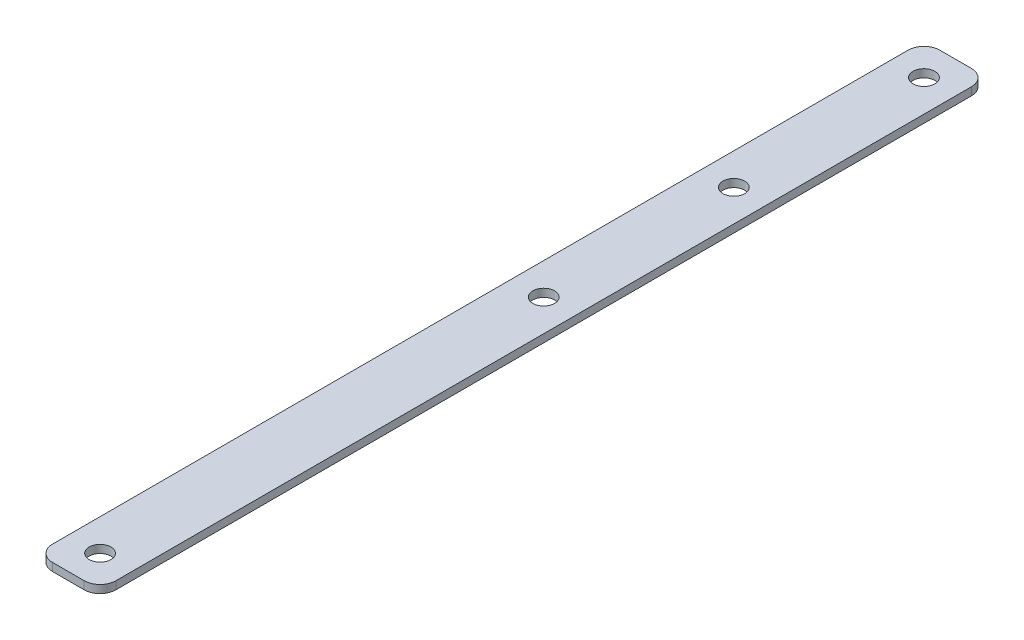
ISO-10303-21;
HEADER;
FILE_DESCRIPTION(('STEP AP214'),'2;1');
FILE_NAME('part.step','',(''),(''),'','','');
FILE_SCHEMA(('AUTOMOTIVE_DESIGN { 1 0 10303 214 1 1 1 1 }'));
ENDSEC;
DATA;
#1=APPLICATION_CONTEXT('core data for automotive mechanical design processes');
#2=APPLICATION_PROTOCOL_DEFINITION('international standard','automotive_design',2000,#1);
#3=PRODUCT_CONTEXT('',#1,'mechanical');
#4=PRODUCT('Part','Part','',(#3));
#5=PRODUCT_RELATED_PRODUCT_CATEGORY('part','',(#4));
#6=PRODUCT_DEFINITION_FORMATION('','',#4);
#7=PRODUCT_DEFINITION_CONTEXT('part definition',#1,'design');
#8=PRODUCT_DEFINITION('design','',#6,#7);
#9=PRODUCT_DEFINITION_SHAPE('','',#8);
#10=(LENGTH_UNIT() NAMED_UNIT(*) SI_UNIT(.MILLI.,.METRE.));
#11=(NAMED_UNIT(*) PLANE_ANGLE_UNIT() SI_UNIT($,.RADIAN.));
#12=(NAMED_UNIT(*) SI_UNIT($,.STERADIAN.) SOLID_ANGLE_UNIT());
#13=UNCERTAINTY_MEASURE_WITH_UNIT(LENGTH_MEASURE(1.E-05),#10,'distance_accuracy_value','');
#14=(GEOMETRIC_REPRESENTATION_CONTEXT(3) GLOBAL_UNCERTAINTY_ASSIGNED_CONTEXT((#13)) GLOBAL_UNIT_ASSIGNED_CONTEXT((#10,
#11,#12)) REPRESENTATION_CONTEXT('',''));
#15=CARTESIAN_POINT('',(0.,0.,0.));
#16=DIRECTION('',(0.,0.,1.));
#17=DIRECTION('',(1.,0.,0.));
#18=AXIS2_PLACEMENT_3D('',#15,#16,#17);
#19=CARTESIAN_POINT('',(3.175,1.5875,-174.625));
#20=DIRECTION('',(0.,1.,0.));
#21=DIRECTION('',(0.,0.,1.));
#22=AXIS2_PLACEMENT_3D('',#19,#20,#21);
#23=PLANE('',#22);
#24=CARTESIAN_POINT('',(6.35,1.5875,-133.35));
#25=DIRECTION('',(0.,1.,0.));
#26=DIRECTION('',(0.,0.,1.));
#27=AXIS2_PLACEMENT_3D('',#24,#25,#26);
#28=CIRCLE('',#27,2.1828125);
#29=CARTESIAN_POINT('',(6.35,1.5875,-131.1671875));
#30=VERTEX_POINT('',#29);
#31=EDGE_CURVE('E193',#30,#30,#28,.T.);
#32=ORIENTED_EDGE('',*,*,#31,.F.);
#33=EDGE_LOOP('',(#32));
#34=FACE_BOUND('',#33,.T.);
#35=CARTESIAN_POINT('',(6.35,1.5875,-171.45));
#36=DIRECTION('',(0.,1.,0.));
#37=DIRECTION('',(0.,0.,1.));
#38=AXIS2_PLACEMENT_3D('',#35,#36,#37);
#39=CIRCLE('',#38,2.1828125);
#40=CARTESIAN_POINT('',(6.35,1.5875,-169.2671875));
#41=VERTEX_POINT('',#40);
#42=EDGE_CURVE('E139',#41,#41,#39,.T.);
#43=ORIENTED_EDGE('',*,*,#42,.F.);
#44=EDGE_LOOP('',(#43));
#45=FACE_BOUND('',#44,.T.);
#46=CARTESIAN_POINT('',(3.175,1.5875,-174.625));
#47=DIRECTION('',(0.,1.,0.));
#48=DIRECTION('',(0.,0.,1.));
#49=AXIS2_PLACEMENT_3D('',#46,#47,#48);
#50=CIRCLE('',#49,3.17500000000001);
#51=CARTESIAN_POINT('',(3.17500000000002,1.5875,-177.8));
#52=VERTEX_POINT('',#51);
#53=CARTESIAN_POINT('',(0.,1.5875,-174.625));
#54=VERTEX_POINT('',#53);
#55=EDGE_CURVE('E150',#52,#54,#50,.T.);
#56=ORIENTED_EDGE('',*,*,#55,.T.);
#57=DIRECTION('',(0.,0.,1.));
#58=VECTOR('',#57,1.);
#59=CARTESIAN_POINT('',(0.,1.5875,-3.17500000000002));
#60=LINE('',#59,#58);
#61=CARTESIAN_POINT('',(0.,1.5875,-3.17500000000002));
#62=VERTEX_POINT('',#61);
#63=EDGE_CURVE('E98',#54,#62,#60,.T.);
#64=ORIENTED_EDGE('',*,*,#63,.T.);
#65=CARTESIAN_POINT('',(3.175,1.5875,-3.175));
#66=DIRECTION('',(0.,1.,0.));
#67=DIRECTION('',(0.,0.,-1.));
#68=AXIS2_PLACEMENT_3D('',#65,#66,#67);
#69=CIRCLE('',#68,3.175);
#70=CARTESIAN_POINT('',(3.17500000000002,1.5875,0.));
#71=VERTEX_POINT('',#70);
#72=EDGE_CURVE('E165',#62,#71,#69,.T.);
#73=ORIENTED_EDGE('',*,*,#72,.T.);
#74=DIRECTION('',(1.,0.,0.));
#75=VECTOR('',#74,1.);
#76=CARTESIAN_POINT('',(3.17500000000002,1.5875,0.));
#77=LINE('',#76,#75);
#78=CARTESIAN_POINT('',(9.52499999999997,1.5875,0.));
#79=VERTEX_POINT('',#78);
#80=EDGE_CURVE('E178',#71,#79,#77,.T.);
#81=ORIENTED_EDGE('',*,*,#80,.T.);
#82=CARTESIAN_POINT('',(9.525,1.5875,-3.175));
#83=DIRECTION('',(0.,1.,0.));
#84=DIRECTION('',(0.,0.,-1.));
#85=AXIS2_PLACEMENT_3D('',#82,#83,#84);
#86=CIRCLE('',#85,3.175);
#87=CARTESIAN_POINT('',(12.7,1.5875,-3.17500000000002));
#88=VERTEX_POINT('',#87);
#89=EDGE_CURVE('E117',#79,#88,#86,.T.);
#90=ORIENTED_EDGE('',*,*,#89,.T.);
#91=DIRECTION('',(0.,0.,-1.));
#92=VECTOR('',#91,1.);
#93=CARTESIAN_POINT('',(12.7,1.5875,-3.17500000000002));
#94=LINE('',#93,#92);
#95=CARTESIAN_POINT('',(12.7,1.5875,-174.625));
#96=VERTEX_POINT('',#95);
#97=EDGE_CURVE('E111',#88,#96,#94,.T.);
#98=ORIENTED_EDGE('',*,*,#97,.T.);
#99=CARTESIAN_POINT('',(9.525,1.5875,-174.625));
#100=DIRECTION('',(0.,1.,0.));
#101=DIRECTION('',(0.,0.,1.));
#102=AXIS2_PLACEMENT_3D('',#99,#100,#101);
#103=CIRCLE('',#102,3.17500000000001);
#104=CARTESIAN_POINT('',(9.52499999999997,1.5875,-177.8));
#105=VERTEX_POINT('',#104);
#106=EDGE_CURVE('E115',#96,#105,#103,.T.);
#107=ORIENTED_EDGE('',*,*,#106,.T.);
#108=DIRECTION('',(-1.,0.,0.));
#109=VECTOR('',#108,1.);
#110=CARTESIAN_POINT('',(3.17500000000002,1.5875,-177.8));
#111=LINE('',#110,#109);
#112=EDGE_CURVE('E55',#105,#52,#111,.T.);
#113=ORIENTED_EDGE('',*,*,#112,.T.);
#114=EDGE_LOOP('',(#56,#64,#73,#81,#90,#98,#107,#113));
#115=FACE_BOUND('',#114,.T.);
#116=CARTESIAN_POINT('',(6.35,1.5875,-6.35));
#117=DIRECTION('',(0.,1.,0.));
#118=DIRECTION('',(0.,0.,1.));
#119=AXIS2_PLACEMENT_3D('',#116,#117,#118);
#120=CIRCLE('',#119,2.1828125);
#121=CARTESIAN_POINT('',(6.35,1.5875,-4.1671875));
#122=VERTEX_POINT('',#121);
#123=EDGE_CURVE('E187',#122,#122,#120,.T.);
#124=ORIENTED_EDGE('',*,*,#123,.F.);
#125=EDGE_LOOP('',(#124));
#126=FACE_BOUND('',#125,.T.);
#127=CARTESIAN_POINT('',(6.35,1.5875,-95.25));
#128=DIRECTION('',(0.,1.,0.));
#129=DIRECTION('',(0.,0.,1.));
#130=AXIS2_PLACEMENT_3D('',#127,#128,#129);
#131=CIRCLE('',#130,2.1828125);
#132=CARTESIAN_POINT('',(6.35,1.5875,-93.0671875));
#133=VERTEX_POINT('',#132);
#134=EDGE_CURVE('E199',#133,#133,#131,.T.);
#135=ORIENTED_EDGE('',*,*,#134,.F.);
#136=EDGE_LOOP('',(#135));
#137=FACE_BOUND('',#136,.T.);
#138=ADVANCED_FACE('F38',(#34,#45,#115,#126,#137),#23,.T.);
#139=CARTESIAN_POINT('',(3.175,0.,-174.625));
#140=DIRECTION('',(0.,1.,0.));
#141=DIRECTION('',(0.,0.,1.));
#142=AXIS2_PLACEMENT_3D('',#139,#140,#141);
#143=PLANE('',#142);
#144=CARTESIAN_POINT('',(3.175,0.,-174.625));
#145=DIRECTION('',(0.,1.,0.));
#146=DIRECTION('',(0.,0.,1.));
#147=AXIS2_PLACEMENT_3D('',#144,#145,#146);
#148=CIRCLE('',#147,3.17500000000001);
#149=CARTESIAN_POINT('',(3.17500000000002,0.,-177.8));
#150=VERTEX_POINT('',#149);
#151=CARTESIAN_POINT('',(0.,0.,-174.625));
#152=VERTEX_POINT('',#151);
#153=EDGE_CURVE('E135',#150,#152,#148,.T.);
#154=ORIENTED_EDGE('',*,*,#153,.F.);
#155=DIRECTION('',(-1.,0.,0.));
#156=VECTOR('',#155,1.);
#157=CARTESIAN_POINT('',(3.17500000000002,0.,-177.8));
#158=LINE('',#157,#156);
#159=CARTESIAN_POINT('',(9.52499999999997,0.,-177.8));
#160=VERTEX_POINT('',#159);
#161=EDGE_CURVE('E90',#160,#150,#158,.T.);
#162=ORIENTED_EDGE('',*,*,#161,.F.);
#163=CARTESIAN_POINT('',(9.525,0.,-174.625));
#164=DIRECTION('',(0.,1.,0.));
#165=DIRECTION('',(0.,0.,1.));
#166=AXIS2_PLACEMENT_3D('',#163,#164,#165);
#167=CIRCLE('',#166,3.17500000000001);
#168=CARTESIAN_POINT('',(12.7,0.,-174.625));
#169=VERTEX_POINT('',#168);
#170=EDGE_CURVE('E84',#169,#160,#167,.T.);
#171=ORIENTED_EDGE('',*,*,#170,.F.);
#172=DIRECTION('',(0.,0.,-1.));
#173=VECTOR('',#172,1.);
#174=CARTESIAN_POINT('',(12.7,0.,-3.17500000000002));
#175=LINE('',#174,#173);
#176=CARTESIAN_POINT('',(12.7,0.,-3.17500000000002));
#177=VERTEX_POINT('',#176);
#178=EDGE_CURVE('E125',#177,#169,#175,.T.);
#179=ORIENTED_EDGE('',*,*,#178,.F.);
#180=CARTESIAN_POINT('',(9.525,0.,-3.175));
#181=DIRECTION('',(0.,1.,0.));
#182=DIRECTION('',(0.,0.,-1.));
#183=AXIS2_PLACEMENT_3D('',#180,#181,#182);
#184=CIRCLE('',#183,3.175);
#185=CARTESIAN_POINT('',(9.52499999999997,0.,0.));
#186=VERTEX_POINT('',#185);
#187=EDGE_CURVE('E145',#186,#177,#184,.T.);
#188=ORIENTED_EDGE('',*,*,#187,.F.);
#189=DIRECTION('',(1.,0.,0.));
#190=VECTOR('',#189,1.);
#191=CARTESIAN_POINT('',(3.17500000000002,0.,0.));
#192=LINE('',#191,#190);
#193=CARTESIAN_POINT('',(3.17500000000002,0.,0.));
#194=VERTEX_POINT('',#193);
#195=EDGE_CURVE('E143',#194,#186,#192,.T.);
#196=ORIENTED_EDGE('',*,*,#195,.F.);
#197=CARTESIAN_POINT('',(3.175,0.,-3.175));
#198=DIRECTION('',(0.,1.,0.));
#199=DIRECTION('',(0.,0.,-1.));
#200=AXIS2_PLACEMENT_3D('',#197,#198,#199);
#201=CIRCLE('',#200,3.175);
#202=CARTESIAN_POINT('',(0.,0.,-3.17500000000002));
#203=VERTEX_POINT('',#202);
#204=EDGE_CURVE('E141',#203,#194,#201,.T.);
#205=ORIENTED_EDGE('',*,*,#204,.F.);
#206=DIRECTION('',(0.,0.,1.));
#207=VECTOR('',#206,1.);
#208=CARTESIAN_POINT('',(0.,0.,-3.17500000000002));
#209=LINE('',#208,#207);
#210=EDGE_CURVE('E138',#152,#203,#209,.T.);
#211=ORIENTED_EDGE('',*,*,#210,.F.);
#212=EDGE_LOOP('',(#154,#162,#171,#179,#188,#196,#205,#211));
#213=FACE_BOUND('',#212,.T.);
#214=CARTESIAN_POINT('',(6.35,0.,-171.45));
#215=DIRECTION('',(0.,1.,0.));
#216=DIRECTION('',(0.,0.,1.));
#217=AXIS2_PLACEMENT_3D('',#214,#215,#216);
#218=CIRCLE('',#217,2.1828125);
#219=CARTESIAN_POINT('',(6.35,0.,-169.2671875));
#220=VERTEX_POINT('',#219);
#221=EDGE_CURVE('E184',#220,#220,#218,.T.);
#222=ORIENTED_EDGE('',*,*,#221,.T.);
#223=EDGE_LOOP('',(#222));
#224=FACE_BOUND('',#223,.T.);
#225=CARTESIAN_POINT('',(6.35,0.,-6.35));
#226=DIRECTION('',(0.,1.,0.));
#227=DIRECTION('',(0.,0.,1.));
#228=AXIS2_PLACEMENT_3D('',#225,#226,#227);
#229=CIRCLE('',#228,2.1828125);
#230=CARTESIAN_POINT('',(6.35,0.,-4.1671875));
#231=VERTEX_POINT('',#230);
#232=EDGE_CURVE('E190',#231,#231,#229,.T.);
#233=ORIENTED_EDGE('',*,*,#232,.T.);
#234=EDGE_LOOP('',(#233));
#235=FACE_BOUND('',#234,.T.);
#236=CARTESIAN_POINT('',(6.35,0.,-133.35));
#237=DIRECTION('',(0.,1.,0.));
#238=DIRECTION('',(0.,0.,1.));
#239=AXIS2_PLACEMENT_3D('',#236,#237,#238);
#240=CIRCLE('',#239,2.1828125);
#241=CARTESIAN_POINT('',(6.35,0.,-131.1671875));
#242=VERTEX_POINT('',#241);
#243=EDGE_CURVE('E196',#242,#242,#240,.T.);
#244=ORIENTED_EDGE('',*,*,#243,.T.);
#245=EDGE_LOOP('',(#244));
#246=FACE_BOUND('',#245,.T.);
#247=CARTESIAN_POINT('',(6.35,0.,-95.25));
#248=DIRECTION('',(0.,1.,0.));
#249=DIRECTION('',(0.,0.,1.));
#250=AXIS2_PLACEMENT_3D('',#247,#248,#249);
#251=CIRCLE('',#250,2.1828125);
#252=CARTESIAN_POINT('',(6.35,0.,-93.0671875));
#253=VERTEX_POINT('',#252);
#254=EDGE_CURVE('E202',#253,#253,#251,.T.);
#255=ORIENTED_EDGE('',*,*,#254,.T.);
#256=EDGE_LOOP('',(#255));
#257=FACE_BOUND('',#256,.T.);
#258=ADVANCED_FACE('F169',(#213,#224,#235,#246,#257),#143,.F.);
#259=CARTESIAN_POINT('',(3.175,1.5875,-174.625));
#260=DIRECTION('',(0.,-1.,0.));
#261=DIRECTION('',(0.,0.,-1.));
#262=AXIS2_PLACEMENT_3D('',#259,#260,#261);
#263=CYLINDRICAL_SURFACE('',#262,3.17500000000001);
#264=ORIENTED_EDGE('',*,*,#153,.T.);
#265=DIRECTION('',(0.,-1.,0.));
#266=VECTOR('',#265,1.);
#267=CARTESIAN_POINT('',(0.,1.5875,-174.625));
#268=LINE('',#267,#266);
#269=EDGE_CURVE('E11',#54,#152,#268,.T.);
#270=ORIENTED_EDGE('',*,*,#269,.F.);
#271=ORIENTED_EDGE('',*,*,#55,.F.);
#272=DIRECTION('',(0.,-1.,0.));
#273=VECTOR('',#272,1.);
#274=CARTESIAN_POINT('',(3.17500000000002,1.5875,-177.8));
#275=LINE('',#274,#273);
#276=EDGE_CURVE('E131',#52,#150,#275,.T.);
#277=ORIENTED_EDGE('',*,*,#276,.T.);
#278=EDGE_LOOP('',(#264,#270,#271,#277));
#279=FACE_BOUND('',#278,.T.);
#280=ADVANCED_FACE('F40',(#279),#263,.T.);
#281=CARTESIAN_POINT('',(0.,1.5875,-3.17500000000002));
#282=DIRECTION('',(1.,0.,0.));
#283=DIRECTION('',(0.,0.,-1.));
#284=AXIS2_PLACEMENT_3D('',#281,#282,#283);
#285=PLANE('',#284);
#286=ORIENTED_EDGE('',*,*,#210,.T.);
#287=DIRECTION('',(0.,-1.,0.));
#288=VECTOR('',#287,1.);
#289=CARTESIAN_POINT('',(0.,1.5875,-3.17500000000002));
#290=LINE('',#289,#288);
#291=EDGE_CURVE('E47',#62,#203,#290,.T.);
#292=ORIENTED_EDGE('',*,*,#291,.F.);
#293=ORIENTED_EDGE('',*,*,#63,.F.);
#294=ORIENTED_EDGE('',*,*,#269,.T.);
#295=EDGE_LOOP('',(#286,#292,#293,#294));
#296=FACE_BOUND('',#295,.T.);
#297=ADVANCED_FACE('F236',(#296),#285,.F.);
#298=CARTESIAN_POINT('',(3.175,1.5875,-3.175));
#299=DIRECTION('',(0.,-1.,0.));
#300=DIRECTION('',(0.,0.,-1.));
#301=AXIS2_PLACEMENT_3D('',#298,#299,#300);
#302=CYLINDRICAL_SURFACE('',#301,3.175);
#303=ORIENTED_EDGE('',*,*,#204,.T.);
#304=DIRECTION('',(0.,-1.,0.));
#305=VECTOR('',#304,1.);
#306=CARTESIAN_POINT('',(3.17500000000002,1.5875,0.));
#307=LINE('',#306,#305);
#308=EDGE_CURVE('E157',#71,#194,#307,.T.);
#309=ORIENTED_EDGE('',*,*,#308,.F.);
#310=ORIENTED_EDGE('',*,*,#72,.F.);
#311=ORIENTED_EDGE('',*,*,#291,.T.);
#312=EDGE_LOOP('',(#303,#309,#310,#311));
#313=FACE_BOUND('',#312,.T.);
#314=ADVANCED_FACE('F163',(#313),#302,.T.);
#315=CARTESIAN_POINT('',(3.17500000000002,1.5875,0.));
#316=DIRECTION('',(0.,0.,-1.));
#317=DIRECTION('',(-1.,0.,0.));
#318=AXIS2_PLACEMENT_3D('',#315,#316,#317);
#319=PLANE('',#318);
#320=ORIENTED_EDGE('',*,*,#195,.T.);
#321=DIRECTION('',(0.,-1.,0.));
#322=VECTOR('',#321,1.);
#323=CARTESIAN_POINT('',(9.52499999999997,1.5875,0.));
#324=LINE('',#323,#322);
#325=EDGE_CURVE('E154',#79,#186,#324,.T.);
#326=ORIENTED_EDGE('',*,*,#325,.F.);
#327=ORIENTED_EDGE('',*,*,#80,.F.);
#328=ORIENTED_EDGE('',*,*,#308,.T.);
#329=EDGE_LOOP('',(#320,#326,#327,#328));
#330=FACE_BOUND('',#329,.T.);
#331=ADVANCED_FACE('F174',(#330),#319,.F.);
#332=CARTESIAN_POINT('',(9.525,1.5875,-3.175));
#333=DIRECTION('',(0.,-1.,0.));
#334=DIRECTION('',(0.,0.,-1.));
#335=AXIS2_PLACEMENT_3D('',#332,#333,#334);
#336=CYLINDRICAL_SURFACE('',#335,3.175);
#337=ORIENTED_EDGE('',*,*,#187,.T.);
#338=DIRECTION('',(0.,-1.,0.));
#339=VECTOR('',#338,1.);
#340=CARTESIAN_POINT('',(12.7,1.5875,-3.17500000000002));
#341=LINE('',#340,#339);
#342=EDGE_CURVE('E126',#88,#177,#341,.T.);
#343=ORIENTED_EDGE('',*,*,#342,.F.);
#344=ORIENTED_EDGE('',*,*,#89,.F.);
#345=ORIENTED_EDGE('',*,*,#325,.T.);
#346=EDGE_LOOP('',(#337,#343,#344,#345));
#347=FACE_BOUND('',#346,.T.);
#348=ADVANCED_FACE('F177',(#347),#336,.T.);
#349=CARTESIAN_POINT('',(12.7,1.5875,-3.17500000000002));
#350=DIRECTION('',(-1.,0.,0.));
#351=DIRECTION('',(0.,0.,1.));
#352=AXIS2_PLACEMENT_3D('',#349,#350,#351);
#353=PLANE('',#352);
#354=ORIENTED_EDGE('',*,*,#178,.T.);
#355=DIRECTION('',(0.,-1.,0.));
#356=VECTOR('',#355,1.);
#357=CARTESIAN_POINT('',(12.7,1.5875,-174.625));
#358=LINE('',#357,#356);
#359=EDGE_CURVE('E122',#96,#169,#358,.T.);
#360=ORIENTED_EDGE('',*,*,#359,.F.);
#361=ORIENTED_EDGE('',*,*,#97,.F.);
#362=ORIENTED_EDGE('',*,*,#342,.T.);
#363=EDGE_LOOP('',(#354,#360,#361,#362));
#364=FACE_BOUND('',#363,.T.);
#365=ADVANCED_FACE('F123',(#364),#353,.F.);
#366=CARTESIAN_POINT('',(9.525,1.5875,-174.625));
#367=DIRECTION('',(0.,-1.,0.));
#368=DIRECTION('',(0.,0.,-1.));
#369=AXIS2_PLACEMENT_3D('',#366,#367,#368);
#370=CYLINDRICAL_SURFACE('',#369,3.17500000000001);
#371=ORIENTED_EDGE('',*,*,#170,.T.);
#372=DIRECTION('',(0.,-1.,0.));
#373=VECTOR('',#372,1.);
#374=CARTESIAN_POINT('',(9.52499999999997,1.5875,-177.8));
#375=LINE('',#374,#373);
#376=EDGE_CURVE('E127',#105,#160,#375,.T.);
#377=ORIENTED_EDGE('',*,*,#376,.F.);
#378=ORIENTED_EDGE('',*,*,#106,.F.);
#379=ORIENTED_EDGE('',*,*,#359,.T.);
#380=EDGE_LOOP('',(#371,#377,#378,#379));
#381=FACE_BOUND('',#380,.T.);
#382=ADVANCED_FACE('F129',(#381),#370,.T.);
#383=CARTESIAN_POINT('',(3.17500000000002,1.5875,-177.8));
#384=DIRECTION('',(0.,0.,1.));
#385=DIRECTION('',(1.,0.,0.));
#386=AXIS2_PLACEMENT_3D('',#383,#384,#385);
#387=PLANE('',#386);
#388=ORIENTED_EDGE('',*,*,#161,.T.);
#389=ORIENTED_EDGE('',*,*,#276,.F.);
#390=ORIENTED_EDGE('',*,*,#112,.F.);
#391=ORIENTED_EDGE('',*,*,#376,.T.);
#392=EDGE_LOOP('',(#388,#389,#390,#391));
#393=FACE_BOUND('',#392,.T.);
#394=ADVANCED_FACE('F224',(#393),#387,.F.);
#395=CARTESIAN_POINT('',(6.35,1.5875,-171.45));
#396=DIRECTION('',(0.,-1.,0.));
#397=DIRECTION('',(0.,0.,-1.));
#398=AXIS2_PLACEMENT_3D('',#395,#396,#397);
#399=CYLINDRICAL_SURFACE('',#398,2.1828125);
#400=ORIENTED_EDGE('',*,*,#42,.T.);
#401=EDGE_LOOP('',(#400));
#402=FACE_BOUND('',#401,.T.);
#403=ORIENTED_EDGE('',*,*,#221,.F.);
#404=EDGE_LOOP('',(#403));
#405=FACE_BOUND('',#404,.T.);
#406=ADVANCED_FACE('F221',(#402,#405),#399,.F.);
#407=CARTESIAN_POINT('',(6.35,1.5875,-6.35));
#408=DIRECTION('',(0.,-1.,0.));
#409=DIRECTION('',(0.,0.,-1.));
#410=AXIS2_PLACEMENT_3D('',#407,#408,#409);
#411=CYLINDRICAL_SURFACE('',#410,2.1828125);
#412=ORIENTED_EDGE('',*,*,#123,.T.);
#413=EDGE_LOOP('',(#412));
#414=FACE_BOUND('',#413,.T.);
#415=ORIENTED_EDGE('',*,*,#232,.F.);
#416=EDGE_LOOP('',(#415));
#417=FACE_BOUND('',#416,.T.);
#418=ADVANCED_FACE('F300',(#414,#417),#411,.F.);
#419=CARTESIAN_POINT('',(6.35,1.5875,-133.35));
#420=DIRECTION('',(0.,-1.,0.));
#421=DIRECTION('',(0.,0.,-1.));
#422=AXIS2_PLACEMENT_3D('',#419,#420,#421);
#423=CYLINDRICAL_SURFACE('',#422,2.1828125);
#424=ORIENTED_EDGE('',*,*,#31,.T.);
#425=EDGE_LOOP('',(#424));
#426=FACE_BOUND('',#425,.T.);
#427=ORIENTED_EDGE('',*,*,#243,.F.);
#428=EDGE_LOOP('',(#427));
#429=FACE_BOUND('',#428,.T.);
#430=ADVANCED_FACE('F308',(#426,#429),#423,.F.);
#431=CARTESIAN_POINT('',(6.35,1.5875,-95.25));
#432=DIRECTION('',(0.,-1.,0.));
#433=DIRECTION('',(0.,0.,-1.));
#434=AXIS2_PLACEMENT_3D('',#431,#432,#433);
#435=CYLINDRICAL_SURFACE('',#434,2.1828125);
#436=ORIENTED_EDGE('',*,*,#134,.T.);
#437=EDGE_LOOP('',(#436));
#438=FACE_BOUND('',#437,.T.);
#439=ORIENTED_EDGE('',*,*,#254,.F.);
#440=EDGE_LOOP('',(#439));
#441=FACE_BOUND('',#440,.T.);
#442=ADVANCED_FACE('F208',(#438,#441),#435,.F.);
#443=CLOSED_SHELL('',(#138,#258,#280,#297,#314,#331,#348,#365,#382,#394,#406,#418,#430,#442));
#444=MANIFOLD_SOLID_BREP('B2',#443);
#445=ADVANCED_BREP_SHAPE_REPRESENTATION('',(#18,#444),#14);
#446=SHAPE_DEFINITION_REPRESENTATION(#9,#445);
ENDSEC;
END-ISO-10303-21;
